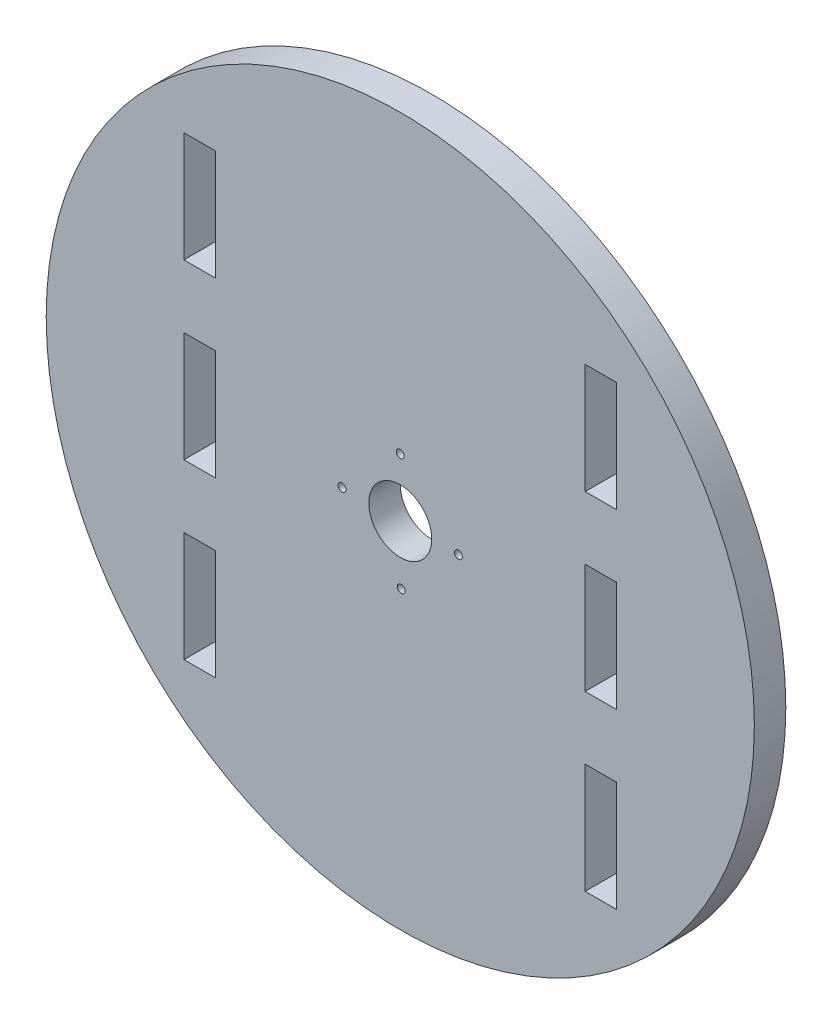
ISO-10303-21;
HEADER;
FILE_DESCRIPTION(('STEP AP214'),'2;1');
FILE_NAME('part.step','',(''),(''),'','','');
FILE_SCHEMA(('AUTOMOTIVE_DESIGN { 1 0 10303 214 1 1 1 1 }'));
ENDSEC;
DATA;
#1=APPLICATION_CONTEXT('core data for automotive mechanical design processes');
#2=APPLICATION_PROTOCOL_DEFINITION('international standard','automotive_design',2000,#1);
#3=PRODUCT_CONTEXT('',#1,'mechanical');
#4=PRODUCT('Part','Part','',(#3));
#5=PRODUCT_RELATED_PRODUCT_CATEGORY('part','',(#4));
#6=PRODUCT_DEFINITION_FORMATION('','',#4);
#7=PRODUCT_DEFINITION_CONTEXT('part definition',#1,'design');
#8=PRODUCT_DEFINITION('design','',#6,#7);
#9=PRODUCT_DEFINITION_SHAPE('','',#8);
#10=(LENGTH_UNIT() NAMED_UNIT(*) SI_UNIT(.MILLI.,.METRE.));
#11=(NAMED_UNIT(*) PLANE_ANGLE_UNIT() SI_UNIT($,.RADIAN.));
#12=(NAMED_UNIT(*) SI_UNIT($,.STERADIAN.) SOLID_ANGLE_UNIT());
#13=UNCERTAINTY_MEASURE_WITH_UNIT(LENGTH_MEASURE(1.E-05),#10,'distance_accuracy_value','');
#14=(GEOMETRIC_REPRESENTATION_CONTEXT(3) GLOBAL_UNCERTAINTY_ASSIGNED_CONTEXT((#13)) GLOBAL_UNIT_ASSIGNED_CONTEXT((#10,
#11,#12)) REPRESENTATION_CONTEXT('',''));
#15=CARTESIAN_POINT('',(0.,0.,0.));
#16=DIRECTION('',(0.,0.,1.));
#17=DIRECTION('',(1.,0.,0.));
#18=AXIS2_PLACEMENT_3D('',#15,#16,#17);
#19=CARTESIAN_POINT('',(68.5,-54.1414213562373,4.));
#20=DIRECTION('',(1.,0.,0.));
#21=DIRECTION('',(0.,0.,-1.));
#22=AXIS2_PLACEMENT_3D('',#19,#20,#21);
#23=PLANE('',#22);
#24=DIRECTION('',(0.,-1.,0.));
#25=VECTOR('',#24,1.);
#26=CARTESIAN_POINT('',(68.5,-54.1414213562373,0.));
#27=LINE('',#26,#25);
#28=CARTESIAN_POINT('',(68.5,74.,0.));
#29=VERTEX_POINT('',#28);
#30=CARTESIAN_POINT('',(68.5,60.,0.));
#31=VERTEX_POINT('',#30);
#32=EDGE_CURVE('E343',#29,#31,#27,.T.);
#33=ORIENTED_EDGE('',*,*,#32,.F.);
#34=DIRECTION('',(0.,0.,-1.));
#35=VECTOR('',#34,1.);
#36=CARTESIAN_POINT('',(68.5,74.,4.));
#37=LINE('',#36,#35);
#38=CARTESIAN_POINT('',(68.5,74.,4.));
#39=VERTEX_POINT('',#38);
#40=EDGE_CURVE('E11',#39,#29,#37,.T.);
#41=ORIENTED_EDGE('',*,*,#40,.F.);
#42=DIRECTION('',(0.,-1.,0.));
#43=VECTOR('',#42,1.);
#44=CARTESIAN_POINT('',(68.5,-54.1414213562373,4.));
#45=LINE('',#44,#43);
#46=CARTESIAN_POINT('',(68.5,60.,4.));
#47=VERTEX_POINT('',#46);
#48=EDGE_CURVE('E215',#39,#47,#45,.T.);
#49=ORIENTED_EDGE('',*,*,#48,.T.);
#50=DIRECTION('',(0.,0.,-1.));
#51=VECTOR('',#50,1.);
#52=CARTESIAN_POINT('',(68.5,60.,4.));
#53=LINE('',#52,#51);
#54=EDGE_CURVE('E51',#47,#31,#53,.T.);
#55=ORIENTED_EDGE('',*,*,#54,.T.);
#56=EDGE_LOOP('',(#33,#41,#49,#55));
#57=FACE_BOUND('',#56,.T.);
#58=ADVANCED_FACE('F32',(#57),#23,.T.);
#59=CARTESIAN_POINT('',(45.,74.,4.));
#60=DIRECTION('',(0.,1.,0.));
#61=DIRECTION('',(0.,0.,1.));
#62=AXIS2_PLACEMENT_3D('',#59,#60,#61);
#63=PLANE('',#62);
#64=DIRECTION('',(1.,0.,0.));
#65=VECTOR('',#64,1.);
#66=CARTESIAN_POINT('',(45.,74.,0.));
#67=LINE('',#66,#65);
#68=CARTESIAN_POINT('',(72.5,74.,0.));
#69=VERTEX_POINT('',#68);
#70=EDGE_CURVE('E220',#29,#69,#67,.T.);
#71=ORIENTED_EDGE('',*,*,#70,.T.);
#72=DIRECTION('',(0.,0.,-1.));
#73=VECTOR('',#72,1.);
#74=CARTESIAN_POINT('',(72.5,74.,4.));
#75=LINE('',#74,#73);
#76=CARTESIAN_POINT('',(72.5,74.,4.));
#77=VERTEX_POINT('',#76);
#78=EDGE_CURVE('E42',#77,#69,#75,.T.);
#79=ORIENTED_EDGE('',*,*,#78,.F.);
#80=DIRECTION('',(1.,0.,0.));
#81=VECTOR('',#80,1.);
#82=CARTESIAN_POINT('',(45.,74.,4.));
#83=LINE('',#82,#81);
#84=EDGE_CURVE('E209',#39,#77,#83,.T.);
#85=ORIENTED_EDGE('',*,*,#84,.F.);
#86=ORIENTED_EDGE('',*,*,#40,.T.);
#87=EDGE_LOOP('',(#71,#79,#85,#86));
#88=FACE_BOUND('',#87,.T.);
#89=ADVANCED_FACE('F218',(#88),#63,.F.);
#90=CARTESIAN_POINT('',(72.5,-54.1414213562373,4.));
#91=DIRECTION('',(1.,0.,0.));
#92=DIRECTION('',(0.,0.,-1.));
#93=AXIS2_PLACEMENT_3D('',#90,#91,#92);
#94=PLANE('',#93);
#95=DIRECTION('',(0.,-1.,0.));
#96=VECTOR('',#95,1.);
#97=CARTESIAN_POINT('',(72.5,-54.1414213562373,0.));
#98=LINE('',#97,#96);
#99=CARTESIAN_POINT('',(72.5,60.,0.));
#100=VERTEX_POINT('',#99);
#101=EDGE_CURVE('E346',#69,#100,#98,.T.);
#102=ORIENTED_EDGE('',*,*,#101,.T.);
#103=DIRECTION('',(0.,0.,-1.));
#104=VECTOR('',#103,1.);
#105=CARTESIAN_POINT('',(72.5,60.,4.));
#106=LINE('',#105,#104);
#107=CARTESIAN_POINT('',(72.5,60.,4.));
#108=VERTEX_POINT('',#107);
#109=EDGE_CURVE('E125',#108,#100,#106,.T.);
#110=ORIENTED_EDGE('',*,*,#109,.F.);
#111=DIRECTION('',(0.,-1.,0.));
#112=VECTOR('',#111,1.);
#113=CARTESIAN_POINT('',(72.5,-54.1414213562373,4.));
#114=LINE('',#113,#112);
#115=EDGE_CURVE('E201',#77,#108,#114,.T.);
#116=ORIENTED_EDGE('',*,*,#115,.F.);
#117=ORIENTED_EDGE('',*,*,#78,.T.);
#118=EDGE_LOOP('',(#102,#110,#116,#117));
#119=FACE_BOUND('',#118,.T.);
#120=ADVANCED_FACE('F203',(#119),#94,.F.);
#121=CARTESIAN_POINT('',(45.,16.,4.));
#122=DIRECTION('',(0.,1.,0.));
#123=DIRECTION('',(0.,0.,1.));
#124=AXIS2_PLACEMENT_3D('',#121,#122,#123);
#125=PLANE('',#124);
#126=DIRECTION('',(1.,0.,0.));
#127=VECTOR('',#126,1.);
#128=CARTESIAN_POINT('',(45.,16.,0.));
#129=LINE('',#128,#127);
#130=CARTESIAN_POINT('',(17.5,16.,0.));
#131=VERTEX_POINT('',#130);
#132=CARTESIAN_POINT('',(21.5,16.,0.));
#133=VERTEX_POINT('',#132);
#134=EDGE_CURVE('E331',#131,#133,#129,.T.);
#135=ORIENTED_EDGE('',*,*,#134,.F.);
#136=DIRECTION('',(0.,0.,-1.));
#137=VECTOR('',#136,1.);
#138=CARTESIAN_POINT('',(17.5,16.,4.));
#139=LINE('',#138,#137);
#140=CARTESIAN_POINT('',(17.5,16.,4.));
#141=VERTEX_POINT('',#140);
#142=EDGE_CURVE('E233',#141,#131,#139,.T.);
#143=ORIENTED_EDGE('',*,*,#142,.F.);
#144=DIRECTION('',(1.,0.,0.));
#145=VECTOR('',#144,1.);
#146=CARTESIAN_POINT('',(45.,16.,4.));
#147=LINE('',#146,#145);
#148=CARTESIAN_POINT('',(21.5,16.,4.));
#149=VERTEX_POINT('',#148);
#150=EDGE_CURVE('E409',#141,#149,#147,.T.);
#151=ORIENTED_EDGE('',*,*,#150,.T.);
#152=DIRECTION('',(0.,0.,-1.));
#153=VECTOR('',#152,1.);
#154=CARTESIAN_POINT('',(21.5,16.,4.));
#155=LINE('',#154,#153);
#156=EDGE_CURVE('E225',#149,#133,#155,.T.);
#157=ORIENTED_EDGE('',*,*,#156,.T.);
#158=EDGE_LOOP('',(#135,#143,#151,#157));
#159=FACE_BOUND('',#158,.T.);
#160=ADVANCED_FACE('F476',(#159),#125,.T.);
#161=CARTESIAN_POINT('',(17.5,-54.1414213562373,4.));
#162=DIRECTION('',(1.,0.,0.));
#163=DIRECTION('',(0.,0.,-1.));
#164=AXIS2_PLACEMENT_3D('',#161,#162,#163);
#165=PLANE('',#164);
#166=DIRECTION('',(0.,-1.,0.));
#167=VECTOR('',#166,1.);
#168=CARTESIAN_POINT('',(17.5,-54.1414213562373,0.));
#169=LINE('',#168,#167);
#170=CARTESIAN_POINT('',(17.5,30.,0.));
#171=VERTEX_POINT('',#170);
#172=EDGE_CURVE('E334',#171,#131,#169,.T.);
#173=ORIENTED_EDGE('',*,*,#172,.F.);
#174=DIRECTION('',(0.,0.,-1.));
#175=VECTOR('',#174,1.);
#176=CARTESIAN_POINT('',(17.5,30.,4.));
#177=LINE('',#176,#175);
#178=CARTESIAN_POINT('',(17.5,30.,4.));
#179=VERTEX_POINT('',#178);
#180=EDGE_CURVE('E231',#179,#171,#177,.T.);
#181=ORIENTED_EDGE('',*,*,#180,.F.);
#182=DIRECTION('',(0.,-1.,0.));
#183=VECTOR('',#182,1.);
#184=CARTESIAN_POINT('',(17.5,-54.1414213562373,4.));
#185=LINE('',#184,#183);
#186=EDGE_CURVE('E412',#179,#141,#185,.T.);
#187=ORIENTED_EDGE('',*,*,#186,.T.);
#188=ORIENTED_EDGE('',*,*,#142,.T.);
#189=EDGE_LOOP('',(#173,#181,#187,#188));
#190=FACE_BOUND('',#189,.T.);
#191=ADVANCED_FACE('F472',(#190),#165,.T.);
#192=CARTESIAN_POINT('',(45.,30.,4.));
#193=DIRECTION('',(0.,1.,0.));
#194=DIRECTION('',(0.,0.,1.));
#195=AXIS2_PLACEMENT_3D('',#192,#193,#194);
#196=PLANE('',#195);
#197=DIRECTION('',(1.,0.,0.));
#198=VECTOR('',#197,1.);
#199=CARTESIAN_POINT('',(45.,30.,0.));
#200=LINE('',#199,#198);
#201=CARTESIAN_POINT('',(21.5,30.,0.));
#202=VERTEX_POINT('',#201);
#203=EDGE_CURVE('E337',#171,#202,#200,.T.);
#204=ORIENTED_EDGE('',*,*,#203,.T.);
#205=DIRECTION('',(0.,0.,-1.));
#206=VECTOR('',#205,1.);
#207=CARTESIAN_POINT('',(21.5,30.,4.));
#208=LINE('',#207,#206);
#209=CARTESIAN_POINT('',(21.5,30.,4.));
#210=VERTEX_POINT('',#209);
#211=EDGE_CURVE('E227',#210,#202,#208,.T.);
#212=ORIENTED_EDGE('',*,*,#211,.F.);
#213=DIRECTION('',(1.,0.,0.));
#214=VECTOR('',#213,1.);
#215=CARTESIAN_POINT('',(45.,30.,4.));
#216=LINE('',#215,#214);
#217=EDGE_CURVE('E415',#179,#210,#216,.T.);
#218=ORIENTED_EDGE('',*,*,#217,.F.);
#219=ORIENTED_EDGE('',*,*,#180,.T.);
#220=EDGE_LOOP('',(#204,#212,#218,#219));
#221=FACE_BOUND('',#220,.T.);
#222=ADVANCED_FACE('F468',(#221),#196,.F.);
#223=CARTESIAN_POINT('',(45.,38.,4.));
#224=DIRECTION('',(0.,-1.,0.));
#225=DIRECTION('',(0.,0.,-1.));
#226=AXIS2_PLACEMENT_3D('',#223,#224,#225);
#227=PLANE('',#226);
#228=DIRECTION('',(-1.,0.,0.));
#229=VECTOR('',#228,1.);
#230=CARTESIAN_POINT('',(45.,38.,0.));
#231=LINE('',#230,#229);
#232=CARTESIAN_POINT('',(21.5,38.,0.));
#233=VERTEX_POINT('',#232);
#234=CARTESIAN_POINT('',(17.5,38.,0.));
#235=VERTEX_POINT('',#234);
#236=EDGE_CURVE('E322',#233,#235,#231,.T.);
#237=ORIENTED_EDGE('',*,*,#236,.T.);
#238=DIRECTION('',(0.,0.,-1.));
#239=VECTOR('',#238,1.);
#240=CARTESIAN_POINT('',(17.5,38.,4.));
#241=LINE('',#240,#239);
#242=CARTESIAN_POINT('',(17.5,38.,4.));
#243=VERTEX_POINT('',#242);
#244=EDGE_CURVE('E228',#243,#235,#241,.T.);
#245=ORIENTED_EDGE('',*,*,#244,.F.);
#246=DIRECTION('',(-1.,0.,0.));
#247=VECTOR('',#246,1.);
#248=CARTESIAN_POINT('',(45.,38.,4.));
#249=LINE('',#248,#247);
#250=CARTESIAN_POINT('',(21.5,38.,4.));
#251=VERTEX_POINT('',#250);
#252=EDGE_CURVE('E400',#251,#243,#249,.T.);
#253=ORIENTED_EDGE('',*,*,#252,.F.);
#254=DIRECTION('',(0.,0.,-1.));
#255=VECTOR('',#254,1.);
#256=CARTESIAN_POINT('',(21.5,38.,4.));
#257=LINE('',#256,#255);
#258=EDGE_CURVE('E235',#251,#233,#257,.T.);
#259=ORIENTED_EDGE('',*,*,#258,.T.);
#260=EDGE_LOOP('',(#237,#245,#253,#259));
#261=FACE_BOUND('',#260,.T.);
#262=ADVANCED_FACE('F471',(#261),#227,.F.);
#263=CARTESIAN_POINT('',(17.5,-54.1414213562373,4.));
#264=DIRECTION('',(-1.,0.,0.));
#265=DIRECTION('',(0.,0.,1.));
#266=AXIS2_PLACEMENT_3D('',#263,#264,#265);
#267=PLANE('',#266);
#268=DIRECTION('',(0.,1.,0.));
#269=VECTOR('',#268,1.);
#270=CARTESIAN_POINT('',(17.5,-54.1414213562373,0.));
#271=LINE('',#270,#269);
#272=CARTESIAN_POINT('',(17.5,52.,0.));
#273=VERTEX_POINT('',#272);
#274=EDGE_CURVE('E325',#235,#273,#271,.T.);
#275=ORIENTED_EDGE('',*,*,#274,.T.);
#276=DIRECTION('',(0.,0.,-1.));
#277=VECTOR('',#276,1.);
#278=CARTESIAN_POINT('',(17.5,52.,4.));
#279=LINE('',#278,#277);
#280=CARTESIAN_POINT('',(17.5,52.,4.));
#281=VERTEX_POINT('',#280);
#282=EDGE_CURVE('E242',#281,#273,#279,.T.);
#283=ORIENTED_EDGE('',*,*,#282,.F.);
#284=DIRECTION('',(0.,1.,0.));
#285=VECTOR('',#284,1.);
#286=CARTESIAN_POINT('',(17.5,-54.1414213562373,4.));
#287=LINE('',#286,#285);
#288=EDGE_CURVE('E403',#243,#281,#287,.T.);
#289=ORIENTED_EDGE('',*,*,#288,.F.);
#290=ORIENTED_EDGE('',*,*,#244,.T.);
#291=EDGE_LOOP('',(#275,#283,#289,#290));
#292=FACE_BOUND('',#291,.T.);
#293=ADVANCED_FACE('F489',(#292),#267,.F.);
#294=CARTESIAN_POINT('',(45.,52.,4.));
#295=DIRECTION('',(0.,1.,0.));
#296=DIRECTION('',(0.,0.,1.));
#297=AXIS2_PLACEMENT_3D('',#294,#295,#296);
#298=PLANE('',#297);
#299=DIRECTION('',(1.,0.,0.));
#300=VECTOR('',#299,1.);
#301=CARTESIAN_POINT('',(45.,52.,0.));
#302=LINE('',#301,#300);
#303=CARTESIAN_POINT('',(21.5,52.,0.));
#304=VERTEX_POINT('',#303);
#305=EDGE_CURVE('E327',#273,#304,#302,.T.);
#306=ORIENTED_EDGE('',*,*,#305,.T.);
#307=DIRECTION('',(0.,0.,-1.));
#308=VECTOR('',#307,1.);
#309=CARTESIAN_POINT('',(21.5,52.,4.));
#310=LINE('',#309,#308);
#311=CARTESIAN_POINT('',(21.5,52.,4.));
#312=VERTEX_POINT('',#311);
#313=EDGE_CURVE('E238',#312,#304,#310,.T.);
#314=ORIENTED_EDGE('',*,*,#313,.F.);
#315=DIRECTION('',(1.,0.,0.));
#316=VECTOR('',#315,1.);
#317=CARTESIAN_POINT('',(45.,52.,4.));
#318=LINE('',#317,#316);
#319=EDGE_CURVE('E405',#281,#312,#318,.T.);
#320=ORIENTED_EDGE('',*,*,#319,.F.);
#321=ORIENTED_EDGE('',*,*,#282,.T.);
#322=EDGE_LOOP('',(#306,#314,#320,#321));
#323=FACE_BOUND('',#322,.T.);
#324=ADVANCED_FACE('F485',(#323),#298,.F.);
#325=CARTESIAN_POINT('',(45.,30.,4.));
#326=DIRECTION('',(0.,1.,0.));
#327=DIRECTION('',(0.,0.,1.));
#328=AXIS2_PLACEMENT_3D('',#325,#326,#327);
#329=PLANE('',#328);
#330=DIRECTION('',(1.,0.,0.));
#331=VECTOR('',#330,1.);
#332=CARTESIAN_POINT('',(45.,30.,0.));
#333=LINE('',#332,#331);
#334=CARTESIAN_POINT('',(68.5,30.,0.));
#335=VERTEX_POINT('',#334);
#336=CARTESIAN_POINT('',(72.5,30.,0.));
#337=VERTEX_POINT('',#336);
#338=EDGE_CURVE('E311',#335,#337,#333,.T.);
#339=ORIENTED_EDGE('',*,*,#338,.T.);
#340=DIRECTION('',(0.,0.,-1.));
#341=VECTOR('',#340,1.);
#342=CARTESIAN_POINT('',(72.5,30.,4.));
#343=LINE('',#342,#341);
#344=CARTESIAN_POINT('',(72.5,30.,4.));
#345=VERTEX_POINT('',#344);
#346=EDGE_CURVE('E239',#345,#337,#343,.T.);
#347=ORIENTED_EDGE('',*,*,#346,.F.);
#348=DIRECTION('',(1.,0.,0.));
#349=VECTOR('',#348,1.);
#350=CARTESIAN_POINT('',(45.,30.,4.));
#351=LINE('',#350,#349);
#352=CARTESIAN_POINT('',(68.5,30.,4.));
#353=VERTEX_POINT('',#352);
#354=EDGE_CURVE('E390',#353,#345,#351,.T.);
#355=ORIENTED_EDGE('',*,*,#354,.F.);
#356=DIRECTION('',(0.,0.,-1.));
#357=VECTOR('',#356,1.);
#358=CARTESIAN_POINT('',(68.5,30.,4.));
#359=LINE('',#358,#357);
#360=EDGE_CURVE('E247',#353,#335,#359,.T.);
#361=ORIENTED_EDGE('',*,*,#360,.T.);
#362=EDGE_LOOP('',(#339,#347,#355,#361));
#363=FACE_BOUND('',#362,.T.);
#364=ADVANCED_FACE('F488',(#363),#329,.F.);
#365=CARTESIAN_POINT('',(72.5,-54.1414213562373,4.));
#366=DIRECTION('',(1.,0.,0.));
#367=DIRECTION('',(0.,0.,-1.));
#368=AXIS2_PLACEMENT_3D('',#365,#366,#367);
#369=PLANE('',#368);
#370=DIRECTION('',(0.,-1.,0.));
#371=VECTOR('',#370,1.);
#372=CARTESIAN_POINT('',(72.5,-54.1414213562373,0.));
#373=LINE('',#372,#371);
#374=CARTESIAN_POINT('',(72.5,16.,0.));
#375=VERTEX_POINT('',#374);
#376=EDGE_CURVE('E314',#337,#375,#373,.T.);
#377=ORIENTED_EDGE('',*,*,#376,.T.);
#378=DIRECTION('',(0.,0.,-1.));
#379=VECTOR('',#378,1.);
#380=CARTESIAN_POINT('',(72.5,16.,4.));
#381=LINE('',#380,#379);
#382=CARTESIAN_POINT('',(72.5,16.,4.));
#383=VERTEX_POINT('',#382);
#384=EDGE_CURVE('E252',#383,#375,#381,.T.);
#385=ORIENTED_EDGE('',*,*,#384,.F.);
#386=DIRECTION('',(0.,-1.,0.));
#387=VECTOR('',#386,1.);
#388=CARTESIAN_POINT('',(72.5,-54.1414213562373,4.));
#389=LINE('',#388,#387);
#390=EDGE_CURVE('E393',#345,#383,#389,.T.);
#391=ORIENTED_EDGE('',*,*,#390,.F.);
#392=ORIENTED_EDGE('',*,*,#346,.T.);
#393=EDGE_LOOP('',(#377,#385,#391,#392));
#394=FACE_BOUND('',#393,.T.);
#395=ADVANCED_FACE('F505',(#394),#369,.F.);
#396=CARTESIAN_POINT('',(45.,16.,4.));
#397=DIRECTION('',(0.,-1.,0.));
#398=DIRECTION('',(0.,0.,-1.));
#399=AXIS2_PLACEMENT_3D('',#396,#397,#398);
#400=PLANE('',#399);
#401=DIRECTION('',(-1.,0.,0.));
#402=VECTOR('',#401,1.);
#403=CARTESIAN_POINT('',(45.,16.,0.));
#404=LINE('',#403,#402);
#405=CARTESIAN_POINT('',(68.5,16.,0.));
#406=VERTEX_POINT('',#405);
#407=EDGE_CURVE('E316',#375,#406,#404,.T.);
#408=ORIENTED_EDGE('',*,*,#407,.T.);
#409=DIRECTION('',(0.,0.,-1.));
#410=VECTOR('',#409,1.);
#411=CARTESIAN_POINT('',(68.5,16.,4.));
#412=LINE('',#411,#410);
#413=CARTESIAN_POINT('',(68.5,16.,4.));
#414=VERTEX_POINT('',#413);
#415=EDGE_CURVE('E249',#414,#406,#412,.T.);
#416=ORIENTED_EDGE('',*,*,#415,.F.);
#417=DIRECTION('',(-1.,0.,0.));
#418=VECTOR('',#417,1.);
#419=CARTESIAN_POINT('',(45.,16.,4.));
#420=LINE('',#419,#418);
#421=EDGE_CURVE('E395',#383,#414,#420,.T.);
#422=ORIENTED_EDGE('',*,*,#421,.F.);
#423=ORIENTED_EDGE('',*,*,#384,.T.);
#424=EDGE_LOOP('',(#408,#416,#422,#423));
#425=FACE_BOUND('',#424,.T.);
#426=ADVANCED_FACE('F501',(#425),#400,.F.);
#427=CARTESIAN_POINT('',(45.,38.,4.));
#428=DIRECTION('',(0.,-1.,0.));
#429=DIRECTION('',(0.,0.,-1.));
#430=AXIS2_PLACEMENT_3D('',#427,#428,#429);
#431=PLANE('',#430);
#432=DIRECTION('',(-1.,0.,0.));
#433=VECTOR('',#432,1.);
#434=CARTESIAN_POINT('',(45.,38.,0.));
#435=LINE('',#434,#433);
#436=CARTESIAN_POINT('',(72.5,38.,0.));
#437=VERTEX_POINT('',#436);
#438=CARTESIAN_POINT('',(68.5,38.,0.));
#439=VERTEX_POINT('',#438);
#440=EDGE_CURVE('E302',#437,#439,#435,.T.);
#441=ORIENTED_EDGE('',*,*,#440,.T.);
#442=DIRECTION('',(0.,0.,-1.));
#443=VECTOR('',#442,1.);
#444=CARTESIAN_POINT('',(68.5,38.,4.));
#445=LINE('',#444,#443);
#446=CARTESIAN_POINT('',(68.5,38.,4.));
#447=VERTEX_POINT('',#446);
#448=EDGE_CURVE('E250',#447,#439,#445,.T.);
#449=ORIENTED_EDGE('',*,*,#448,.F.);
#450=DIRECTION('',(-1.,0.,0.));
#451=VECTOR('',#450,1.);
#452=CARTESIAN_POINT('',(45.,38.,4.));
#453=LINE('',#452,#451);
#454=CARTESIAN_POINT('',(72.5,38.,4.));
#455=VERTEX_POINT('',#454);
#456=EDGE_CURVE('E381',#455,#447,#453,.T.);
#457=ORIENTED_EDGE('',*,*,#456,.F.);
#458=DIRECTION('',(0.,0.,-1.));
#459=VECTOR('',#458,1.);
#460=CARTESIAN_POINT('',(72.5,38.,4.));
#461=LINE('',#460,#459);
#462=EDGE_CURVE('E257',#455,#437,#461,.T.);
#463=ORIENTED_EDGE('',*,*,#462,.T.);
#464=EDGE_LOOP('',(#441,#449,#457,#463));
#465=FACE_BOUND('',#464,.T.);
#466=ADVANCED_FACE('F504',(#465),#431,.F.);
#467=CARTESIAN_POINT('',(68.5,-54.1414213562373,4.));
#468=DIRECTION('',(-1.,0.,0.));
#469=DIRECTION('',(0.,0.,1.));
#470=AXIS2_PLACEMENT_3D('',#467,#468,#469);
#471=PLANE('',#470);
#472=DIRECTION('',(0.,1.,0.));
#473=VECTOR('',#472,1.);
#474=CARTESIAN_POINT('',(68.5,-54.1414213562373,0.));
#475=LINE('',#474,#473);
#476=CARTESIAN_POINT('',(68.5,52.,0.));
#477=VERTEX_POINT('',#476);
#478=EDGE_CURVE('E305',#439,#477,#475,.T.);
#479=ORIENTED_EDGE('',*,*,#478,.T.);
#480=DIRECTION('',(0.,0.,-1.));
#481=VECTOR('',#480,1.);
#482=CARTESIAN_POINT('',(68.5,52.,4.));
#483=LINE('',#482,#481);
#484=CARTESIAN_POINT('',(68.5,52.,4.));
#485=VERTEX_POINT('',#484);
#486=EDGE_CURVE('E263',#485,#477,#483,.T.);
#487=ORIENTED_EDGE('',*,*,#486,.F.);
#488=DIRECTION('',(0.,1.,0.));
#489=VECTOR('',#488,1.);
#490=CARTESIAN_POINT('',(68.5,-54.1414213562373,4.));
#491=LINE('',#490,#489);
#492=EDGE_CURVE('E384',#447,#485,#491,.T.);
#493=ORIENTED_EDGE('',*,*,#492,.F.);
#494=ORIENTED_EDGE('',*,*,#448,.T.);
#495=EDGE_LOOP('',(#479,#487,#493,#494));
#496=FACE_BOUND('',#495,.T.);
#497=ADVANCED_FACE('F519',(#496),#471,.F.);
#498=CARTESIAN_POINT('',(45.,52.,4.));
#499=DIRECTION('',(0.,1.,0.));
#500=DIRECTION('',(0.,0.,1.));
#501=AXIS2_PLACEMENT_3D('',#498,#499,#500);
#502=PLANE('',#501);
#503=DIRECTION('',(1.,0.,0.));
#504=VECTOR('',#503,1.);
#505=CARTESIAN_POINT('',(45.,52.,0.));
#506=LINE('',#505,#504);
#507=CARTESIAN_POINT('',(72.5,52.,0.));
#508=VERTEX_POINT('',#507);
#509=EDGE_CURVE('E307',#477,#508,#506,.T.);
#510=ORIENTED_EDGE('',*,*,#509,.T.);
#511=DIRECTION('',(0.,0.,-1.));
#512=VECTOR('',#511,1.);
#513=CARTESIAN_POINT('',(72.5,52.,4.));
#514=LINE('',#513,#512);
#515=CARTESIAN_POINT('',(72.5,52.,4.));
#516=VERTEX_POINT('',#515);
#517=EDGE_CURVE('E260',#516,#508,#514,.T.);
#518=ORIENTED_EDGE('',*,*,#517,.F.);
#519=DIRECTION('',(1.,0.,0.));
#520=VECTOR('',#519,1.);
#521=CARTESIAN_POINT('',(45.,52.,4.));
#522=LINE('',#521,#520);
#523=EDGE_CURVE('E386',#485,#516,#522,.T.);
#524=ORIENTED_EDGE('',*,*,#523,.F.);
#525=ORIENTED_EDGE('',*,*,#486,.T.);
#526=EDGE_LOOP('',(#510,#518,#524,#525));
#527=FACE_BOUND('',#526,.T.);
#528=ADVANCED_FACE('F516',(#527),#502,.F.);
#529=CARTESIAN_POINT('',(17.5,-54.1414213562373,4.));
#530=DIRECTION('',(-1.,0.,0.));
#531=DIRECTION('',(0.,0.,1.));
#532=AXIS2_PLACEMENT_3D('',#529,#530,#531);
#533=PLANE('',#532);
#534=DIRECTION('',(0.,1.,0.));
#535=VECTOR('',#534,1.);
#536=CARTESIAN_POINT('',(17.5,-54.1414213562373,0.));
#537=LINE('',#536,#535);
#538=CARTESIAN_POINT('',(17.5,60.,0.));
#539=VERTEX_POINT('',#538);
#540=CARTESIAN_POINT('',(17.5,74.,0.));
#541=VERTEX_POINT('',#540);
#542=EDGE_CURVE('E285',#539,#541,#537,.T.);
#543=ORIENTED_EDGE('',*,*,#542,.T.);
#544=DIRECTION('',(0.,0.,-1.));
#545=VECTOR('',#544,1.);
#546=CARTESIAN_POINT('',(17.5,74.,4.));
#547=LINE('',#546,#545);
#548=CARTESIAN_POINT('',(17.5,74.,4.));
#549=VERTEX_POINT('',#548);
#550=EDGE_CURVE('E36',#549,#541,#547,.T.);
#551=ORIENTED_EDGE('',*,*,#550,.F.);
#552=DIRECTION('',(0.,1.,0.));
#553=VECTOR('',#552,1.);
#554=CARTESIAN_POINT('',(17.5,-54.1414213562373,4.));
#555=LINE('',#554,#553);
#556=CARTESIAN_POINT('',(17.5,60.,4.));
#557=VERTEX_POINT('',#556);
#558=EDGE_CURVE('E373',#557,#549,#555,.T.);
#559=ORIENTED_EDGE('',*,*,#558,.F.);
#560=DIRECTION('',(0.,0.,-1.));
#561=VECTOR('',#560,1.);
#562=CARTESIAN_POINT('',(17.5,60.,4.));
#563=LINE('',#562,#561);
#564=EDGE_CURVE('E268',#557,#539,#563,.T.);
#565=ORIENTED_EDGE('',*,*,#564,.T.);
#566=EDGE_LOOP('',(#543,#551,#559,#565));
#567=FACE_BOUND('',#566,.T.);
#568=ADVANCED_FACE('F286',(#567),#533,.F.);
#569=CARTESIAN_POINT('',(45.,74.,4.));
#570=DIRECTION('',(0.,1.,0.));
#571=DIRECTION('',(0.,0.,1.));
#572=AXIS2_PLACEMENT_3D('',#569,#570,#571);
#573=PLANE('',#572);
#574=DIRECTION('',(1.,0.,0.));
#575=VECTOR('',#574,1.);
#576=CARTESIAN_POINT('',(45.,74.,0.));
#577=LINE('',#576,#575);
#578=CARTESIAN_POINT('',(21.5,74.,0.));
#579=VERTEX_POINT('',#578);
#580=EDGE_CURVE('E281',#541,#579,#577,.T.);
#581=ORIENTED_EDGE('',*,*,#580,.T.);
#582=DIRECTION('',(0.,0.,-1.));
#583=VECTOR('',#582,1.);
#584=CARTESIAN_POINT('',(21.5,74.,4.));
#585=LINE('',#584,#583);
#586=CARTESIAN_POINT('',(21.5,74.,4.));
#587=VERTEX_POINT('',#586);
#588=EDGE_CURVE('E272',#587,#579,#585,.T.);
#589=ORIENTED_EDGE('',*,*,#588,.F.);
#590=DIRECTION('',(1.,0.,0.));
#591=VECTOR('',#590,1.);
#592=CARTESIAN_POINT('',(45.,74.,4.));
#593=LINE('',#592,#591);
#594=EDGE_CURVE('E138',#549,#587,#593,.T.);
#595=ORIENTED_EDGE('',*,*,#594,.F.);
#596=ORIENTED_EDGE('',*,*,#550,.T.);
#597=EDGE_LOOP('',(#581,#589,#595,#596));
#598=FACE_BOUND('',#597,.T.);
#599=ADVANCED_FACE('F280',(#598),#573,.F.);
#600=CARTESIAN_POINT('',(21.5,-54.1414213562373,4.));
#601=DIRECTION('',(1.,0.,0.));
#602=DIRECTION('',(0.,0.,-1.));
#603=AXIS2_PLACEMENT_3D('',#600,#601,#602);
#604=PLANE('',#603);
#605=DIRECTION('',(0.,-1.,0.));
#606=VECTOR('',#605,1.);
#607=CARTESIAN_POINT('',(21.5,-54.1414213562373,0.));
#608=LINE('',#607,#606);
#609=CARTESIAN_POINT('',(21.5,60.,0.));
#610=VERTEX_POINT('',#609);
#611=EDGE_CURVE('E292',#579,#610,#608,.T.);
#612=ORIENTED_EDGE('',*,*,#611,.T.);
#613=DIRECTION('',(0.,0.,-1.));
#614=VECTOR('',#613,1.);
#615=CARTESIAN_POINT('',(21.5,60.,4.));
#616=LINE('',#615,#614);
#617=CARTESIAN_POINT('',(21.5,60.,4.));
#618=VERTEX_POINT('',#617);
#619=EDGE_CURVE('E270',#618,#610,#616,.T.);
#620=ORIENTED_EDGE('',*,*,#619,.F.);
#621=DIRECTION('',(0.,-1.,0.));
#622=VECTOR('',#621,1.);
#623=CARTESIAN_POINT('',(21.5,-54.1414213562373,4.));
#624=LINE('',#623,#622);
#625=EDGE_CURVE('E376',#587,#618,#624,.T.);
#626=ORIENTED_EDGE('',*,*,#625,.F.);
#627=ORIENTED_EDGE('',*,*,#588,.T.);
#628=EDGE_LOOP('',(#612,#620,#626,#627));
#629=FACE_BOUND('',#628,.T.);
#630=ADVANCED_FACE('F530',(#629),#604,.F.);
#631=CARTESIAN_POINT('',(45.,60.,4.));
#632=DIRECTION('',(0.,1.,0.));
#633=DIRECTION('',(0.,0.,1.));
#634=AXIS2_PLACEMENT_3D('',#631,#632,#633);
#635=PLANE('',#634);
#636=DIRECTION('',(1.,0.,0.));
#637=VECTOR('',#636,1.);
#638=CARTESIAN_POINT('',(45.,60.,0.));
#639=LINE('',#638,#637);
#640=EDGE_CURVE('E348',#31,#100,#639,.T.);
#641=ORIENTED_EDGE('',*,*,#640,.F.);
#642=ORIENTED_EDGE('',*,*,#54,.F.);
#643=DIRECTION('',(1.,0.,0.));
#644=VECTOR('',#643,1.);
#645=CARTESIAN_POINT('',(45.,60.,4.));
#646=LINE('',#645,#644);
#647=EDGE_CURVE('E208',#47,#108,#646,.T.);
#648=ORIENTED_EDGE('',*,*,#647,.T.);
#649=ORIENTED_EDGE('',*,*,#109,.T.);
#650=EDGE_LOOP('',(#641,#642,#648,#649));
#651=FACE_BOUND('',#650,.T.);
#652=ADVANCED_FACE('F466',(#651),#635,.T.);
#653=CARTESIAN_POINT('',(21.5,-54.1414213562373,4.));
#654=DIRECTION('',(1.,0.,0.));
#655=DIRECTION('',(0.,0.,-1.));
#656=AXIS2_PLACEMENT_3D('',#653,#654,#655);
#657=PLANE('',#656);
#658=DIRECTION('',(0.,-1.,0.));
#659=VECTOR('',#658,1.);
#660=CARTESIAN_POINT('',(21.5,-54.1414213562373,0.));
#661=LINE('',#660,#659);
#662=EDGE_CURVE('E340',#202,#133,#661,.T.);
#663=ORIENTED_EDGE('',*,*,#662,.T.);
#664=ORIENTED_EDGE('',*,*,#156,.F.);
#665=DIRECTION('',(0.,-1.,0.));
#666=VECTOR('',#665,1.);
#667=CARTESIAN_POINT('',(21.5,-54.1414213562373,4.));
#668=LINE('',#667,#666);
#669=EDGE_CURVE('E418',#210,#149,#668,.T.);
#670=ORIENTED_EDGE('',*,*,#669,.F.);
#671=ORIENTED_EDGE('',*,*,#211,.T.);
#672=EDGE_LOOP('',(#663,#664,#670,#671));
#673=FACE_BOUND('',#672,.T.);
#674=ADVANCED_FACE('F462',(#673),#657,.F.);
#675=CARTESIAN_POINT('',(21.5,-54.1414213562373,4.));
#676=DIRECTION('',(1.,0.,0.));
#677=DIRECTION('',(0.,0.,-1.));
#678=AXIS2_PLACEMENT_3D('',#675,#676,#677);
#679=PLANE('',#678);
#680=DIRECTION('',(0.,-1.,0.));
#681=VECTOR('',#680,1.);
#682=CARTESIAN_POINT('',(21.5,-54.1414213562373,0.));
#683=LINE('',#682,#681);
#684=EDGE_CURVE('E329',#304,#233,#683,.T.);
#685=ORIENTED_EDGE('',*,*,#684,.T.);
#686=ORIENTED_EDGE('',*,*,#258,.F.);
#687=DIRECTION('',(0.,-1.,0.));
#688=VECTOR('',#687,1.);
#689=CARTESIAN_POINT('',(21.5,-54.1414213562373,4.));
#690=LINE('',#689,#688);
#691=EDGE_CURVE('E407',#312,#251,#690,.T.);
#692=ORIENTED_EDGE('',*,*,#691,.F.);
#693=ORIENTED_EDGE('',*,*,#313,.T.);
#694=EDGE_LOOP('',(#685,#686,#692,#693));
#695=FACE_BOUND('',#694,.T.);
#696=ADVANCED_FACE('F465',(#695),#679,.F.);
#697=CARTESIAN_POINT('',(68.5,-54.1414213562373,4.));
#698=DIRECTION('',(1.,0.,0.));
#699=DIRECTION('',(0.,0.,-1.));
#700=AXIS2_PLACEMENT_3D('',#697,#698,#699);
#701=PLANE('',#700);
#702=DIRECTION('',(0.,-1.,0.));
#703=VECTOR('',#702,1.);
#704=CARTESIAN_POINT('',(68.5,-54.1414213562373,0.));
#705=LINE('',#704,#703);
#706=EDGE_CURVE('E319',#335,#406,#705,.T.);
#707=ORIENTED_EDGE('',*,*,#706,.F.);
#708=ORIENTED_EDGE('',*,*,#360,.F.);
#709=DIRECTION('',(0.,-1.,0.));
#710=VECTOR('',#709,1.);
#711=CARTESIAN_POINT('',(68.5,-54.1414213562373,4.));
#712=LINE('',#711,#710);
#713=EDGE_CURVE('E397',#353,#414,#712,.T.);
#714=ORIENTED_EDGE('',*,*,#713,.T.);
#715=ORIENTED_EDGE('',*,*,#415,.T.);
#716=EDGE_LOOP('',(#707,#708,#714,#715));
#717=FACE_BOUND('',#716,.T.);
#718=ADVANCED_FACE('F483',(#717),#701,.T.);
#719=CARTESIAN_POINT('',(72.5,-54.1414213562373,4.));
#720=DIRECTION('',(1.,0.,0.));
#721=DIRECTION('',(0.,0.,-1.));
#722=AXIS2_PLACEMENT_3D('',#719,#720,#721);
#723=PLANE('',#722);
#724=DIRECTION('',(0.,-1.,0.));
#725=VECTOR('',#724,1.);
#726=CARTESIAN_POINT('',(72.5,-54.1414213562373,0.));
#727=LINE('',#726,#725);
#728=EDGE_CURVE('E309',#508,#437,#727,.T.);
#729=ORIENTED_EDGE('',*,*,#728,.T.);
#730=ORIENTED_EDGE('',*,*,#462,.F.);
#731=DIRECTION('',(0.,-1.,0.));
#732=VECTOR('',#731,1.);
#733=CARTESIAN_POINT('',(72.5,-54.1414213562373,4.));
#734=LINE('',#733,#732);
#735=EDGE_CURVE('E388',#516,#455,#734,.T.);
#736=ORIENTED_EDGE('',*,*,#735,.F.);
#737=ORIENTED_EDGE('',*,*,#517,.T.);
#738=EDGE_LOOP('',(#729,#730,#736,#737));
#739=FACE_BOUND('',#738,.T.);
#740=ADVANCED_FACE('F499',(#739),#723,.F.);
#741=CARTESIAN_POINT('',(45.,60.,4.));
#742=DIRECTION('',(0.,1.,0.));
#743=DIRECTION('',(0.,0.,1.));
#744=AXIS2_PLACEMENT_3D('',#741,#742,#743);
#745=PLANE('',#744);
#746=DIRECTION('',(1.,0.,0.));
#747=VECTOR('',#746,1.);
#748=CARTESIAN_POINT('',(45.,60.,0.));
#749=LINE('',#748,#747);
#750=EDGE_CURVE('E300',#539,#610,#749,.T.);
#751=ORIENTED_EDGE('',*,*,#750,.F.);
#752=ORIENTED_EDGE('',*,*,#564,.F.);
#753=DIRECTION('',(1.,0.,0.));
#754=VECTOR('',#753,1.);
#755=CARTESIAN_POINT('',(45.,60.,4.));
#756=LINE('',#755,#754);
#757=EDGE_CURVE('E378',#557,#618,#756,.T.);
#758=ORIENTED_EDGE('',*,*,#757,.T.);
#759=ORIENTED_EDGE('',*,*,#619,.T.);
#760=EDGE_LOOP('',(#751,#752,#758,#759));
#761=FACE_BOUND('',#760,.T.);
#762=ADVANCED_FACE('F451',(#761),#745,.T.);
#763=CARTESIAN_POINT('',(45.,45.,4.));
#764=DIRECTION('',(0.,0.,-1.));
#765=DIRECTION('',(-1.,0.,0.));
#766=AXIS2_PLACEMENT_3D('',#763,#764,#765);
#767=CYLINDRICAL_SURFACE('',#766,4.);
#768=CARTESIAN_POINT('',(45.,45.,4.));
#769=DIRECTION('',(0.,0.,1.));
#770=DIRECTION('',(1.,0.,0.));
#771=AXIS2_PLACEMENT_3D('',#768,#769,#770);
#772=CIRCLE('',#771,4.);
#773=CARTESIAN_POINT('',(49.,45.,4.));
#774=VERTEX_POINT('',#773);
#775=EDGE_CURVE('E370',#774,#774,#772,.T.);
#776=ORIENTED_EDGE('',*,*,#775,.T.);
#777=EDGE_LOOP('',(#776));
#778=FACE_BOUND('',#777,.T.);
#779=CARTESIAN_POINT('',(45.,45.,0.));
#780=DIRECTION('',(0.,0.,1.));
#781=DIRECTION('',(1.,0.,0.));
#782=AXIS2_PLACEMENT_3D('',#779,#780,#781);
#783=CIRCLE('',#782,4.);
#784=CARTESIAN_POINT('',(49.,45.,0.));
#785=VERTEX_POINT('',#784);
#786=EDGE_CURVE('E290',#785,#785,#783,.T.);
#787=ORIENTED_EDGE('',*,*,#786,.F.);
#788=EDGE_LOOP('',(#787));
#789=FACE_BOUND('',#788,.T.);
#790=ADVANCED_FACE('F441',(#778,#789),#767,.F.);
#791=CARTESIAN_POINT('',(45.,52.4,4.));
#792=DIRECTION('',(0.,0.,-1.));
#793=DIRECTION('',(-1.,0.,0.));
#794=AXIS2_PLACEMENT_3D('',#791,#792,#793);
#795=CYLINDRICAL_SURFACE('',#794,0.5);
#796=CARTESIAN_POINT('',(45.,52.4,4.));
#797=DIRECTION('',(0.,0.,1.));
#798=DIRECTION('',(1.,0.,0.));
#799=AXIS2_PLACEMENT_3D('',#796,#797,#798);
#800=CIRCLE('',#799,0.5);
#801=CARTESIAN_POINT('',(45.5,52.4,4.));
#802=VERTEX_POINT('',#801);
#803=EDGE_CURVE('E367',#802,#802,#800,.T.);
#804=ORIENTED_EDGE('',*,*,#803,.T.);
#805=EDGE_LOOP('',(#804));
#806=FACE_BOUND('',#805,.T.);
#807=CARTESIAN_POINT('',(45.,52.4,0.));
#808=DIRECTION('',(0.,0.,1.));
#809=DIRECTION('',(1.,0.,0.));
#810=AXIS2_PLACEMENT_3D('',#807,#808,#809);
#811=CIRCLE('',#810,0.5);
#812=CARTESIAN_POINT('',(45.5,52.4,0.));
#813=VERTEX_POINT('',#812);
#814=EDGE_CURVE('E295',#813,#813,#811,.T.);
#815=ORIENTED_EDGE('',*,*,#814,.F.);
#816=EDGE_LOOP('',(#815));
#817=FACE_BOUND('',#816,.T.);
#818=ADVANCED_FACE('F438',(#806,#817),#795,.F.);
#819=CARTESIAN_POINT('',(45.1210251621469,37.6009897344221,4.));
#820=DIRECTION('',(0.,0.,-1.));
#821=DIRECTION('',(-1.,0.,0.));
#822=AXIS2_PLACEMENT_3D('',#819,#820,#821);
#823=CYLINDRICAL_SURFACE('',#822,0.5);
#824=CARTESIAN_POINT('',(45.1210251621469,37.6009897344221,4.));
#825=DIRECTION('',(0.,0.,1.));
#826=DIRECTION('',(1.,0.,0.));
#827=AXIS2_PLACEMENT_3D('',#824,#825,#826);
#828=CIRCLE('',#827,0.5);
#829=CARTESIAN_POINT('',(45.6210251621469,37.6009897344221,4.));
#830=VERTEX_POINT('',#829);
#831=EDGE_CURVE('E362',#830,#830,#828,.T.);
#832=ORIENTED_EDGE('',*,*,#831,.T.);
#833=EDGE_LOOP('',(#832));
#834=FACE_BOUND('',#833,.T.);
#835=CARTESIAN_POINT('',(45.1210251621469,37.6009897344221,0.));
#836=DIRECTION('',(0.,0.,1.));
#837=DIRECTION('',(1.,0.,0.));
#838=AXIS2_PLACEMENT_3D('',#835,#836,#837);
#839=CIRCLE('',#838,0.5);
#840=CARTESIAN_POINT('',(45.6210251621469,37.6009897344221,0.));
#841=VERTEX_POINT('',#840);
#842=EDGE_CURVE('E430',#841,#841,#839,.T.);
#843=ORIENTED_EDGE('',*,*,#842,.F.);
#844=EDGE_LOOP('',(#843));
#845=FACE_BOUND('',#844,.T.);
#846=ADVANCED_FACE('F440',(#834,#845),#823,.F.);
#847=CARTESIAN_POINT('',(52.4,45.,4.));
#848=DIRECTION('',(0.,0.,-1.));
#849=DIRECTION('',(-1.,0.,0.));
#850=AXIS2_PLACEMENT_3D('',#847,#848,#849);
#851=CYLINDRICAL_SURFACE('',#850,0.5);
#852=CARTESIAN_POINT('',(52.4,45.,4.));
#853=DIRECTION('',(0.,0.,1.));
#854=DIRECTION('',(1.,0.,0.));
#855=AXIS2_PLACEMENT_3D('',#852,#853,#854);
#856=CIRCLE('',#855,0.5);
#857=CARTESIAN_POINT('',(52.9,45.,4.));
#858=VERTEX_POINT('',#857);
#859=EDGE_CURVE('E357',#858,#858,#856,.T.);
#860=ORIENTED_EDGE('',*,*,#859,.T.);
#861=EDGE_LOOP('',(#860));
#862=FACE_BOUND('',#861,.T.);
#863=CARTESIAN_POINT('',(52.4,45.,0.));
#864=DIRECTION('',(0.,0.,1.));
#865=DIRECTION('',(1.,0.,0.));
#866=AXIS2_PLACEMENT_3D('',#863,#864,#865);
#867=CIRCLE('',#866,0.5);
#868=CARTESIAN_POINT('',(52.9,45.,0.));
#869=VERTEX_POINT('',#868);
#870=EDGE_CURVE('E427',#869,#869,#867,.T.);
#871=ORIENTED_EDGE('',*,*,#870,.F.);
#872=EDGE_LOOP('',(#871));
#873=FACE_BOUND('',#872,.T.);
#874=ADVANCED_FACE('F448',(#862,#873),#851,.F.);
#875=CARTESIAN_POINT('',(37.6,45.,4.));
#876=DIRECTION('',(0.,0.,-1.));
#877=DIRECTION('',(-1.,0.,0.));
#878=AXIS2_PLACEMENT_3D('',#875,#876,#877);
#879=CYLINDRICAL_SURFACE('',#878,0.5);
#880=CARTESIAN_POINT('',(37.6,45.,4.));
#881=DIRECTION('',(0.,0.,1.));
#882=DIRECTION('',(1.,0.,0.));
#883=AXIS2_PLACEMENT_3D('',#880,#881,#882);
#884=CIRCLE('',#883,0.5);
#885=CARTESIAN_POINT('',(38.1,45.,4.));
#886=VERTEX_POINT('',#885);
#887=EDGE_CURVE('E353',#886,#886,#884,.T.);
#888=ORIENTED_EDGE('',*,*,#887,.T.);
#889=EDGE_LOOP('',(#888));
#890=FACE_BOUND('',#889,.T.);
#891=CARTESIAN_POINT('',(37.6,45.,0.));
#892=DIRECTION('',(0.,0.,1.));
#893=DIRECTION('',(1.,0.,0.));
#894=AXIS2_PLACEMENT_3D('',#891,#892,#893);
#895=CIRCLE('',#894,0.5);
#896=CARTESIAN_POINT('',(38.1,45.,0.));
#897=VERTEX_POINT('',#896);
#898=EDGE_CURVE('E424',#897,#897,#895,.T.);
#899=ORIENTED_EDGE('',*,*,#898,.F.);
#900=EDGE_LOOP('',(#899));
#901=FACE_BOUND('',#900,.T.);
#902=ADVANCED_FACE('F34',(#890,#901),#879,.F.);
#903=CARTESIAN_POINT('',(45.,45.,4.));
#904=DIRECTION('',(0.,0.,-1.));
#905=DIRECTION('',(-1.,0.,0.));
#906=AXIS2_PLACEMENT_3D('',#903,#904,#905);
#907=CYLINDRICAL_SURFACE('',#906,45.);
#908=CARTESIAN_POINT('',(45.,45.,4.));
#909=DIRECTION('',(0.,0.,1.));
#910=DIRECTION('',(1.,0.,0.));
#911=AXIS2_PLACEMENT_3D('',#908,#909,#910);
#912=CIRCLE('',#911,45.);
#913=CARTESIAN_POINT('',(90.,45.,4.));
#914=VERTEX_POINT('',#913);
#915=EDGE_CURVE('E271',#914,#914,#912,.T.);
#916=ORIENTED_EDGE('',*,*,#915,.F.);
#917=EDGE_LOOP('',(#916));
#918=FACE_BOUND('',#917,.T.);
#919=CARTESIAN_POINT('',(45.,45.,0.));
#920=DIRECTION('',(0.,0.,1.));
#921=DIRECTION('',(1.,0.,0.));
#922=AXIS2_PLACEMENT_3D('',#919,#920,#921);
#923=CIRCLE('',#922,45.);
#924=CARTESIAN_POINT('',(90.,45.,0.));
#925=VERTEX_POINT('',#924);
#926=EDGE_CURVE('E351',#925,#925,#923,.T.);
#927=ORIENTED_EDGE('',*,*,#926,.T.);
#928=EDGE_LOOP('',(#927));
#929=FACE_BOUND('',#928,.T.);
#930=ADVANCED_FACE('F605',(#918,#929),#907,.T.);
#931=CARTESIAN_POINT('',(45.,-54.1414213562373,4.));
#932=DIRECTION('',(0.,0.,1.));
#933=DIRECTION('',(1.,0.,0.));
#934=AXIS2_PLACEMENT_3D('',#931,#932,#933);
#935=PLANE('',#934);
#936=ORIENTED_EDGE('',*,*,#887,.F.);
#937=EDGE_LOOP('',(#936));
#938=FACE_BOUND('',#937,.T.);
#939=ORIENTED_EDGE('',*,*,#859,.F.);
#940=EDGE_LOOP('',(#939));
#941=FACE_BOUND('',#940,.T.);
#942=ORIENTED_EDGE('',*,*,#831,.F.);
#943=EDGE_LOOP('',(#942));
#944=FACE_BOUND('',#943,.T.);
#945=ORIENTED_EDGE('',*,*,#803,.F.);
#946=EDGE_LOOP('',(#945));
#947=FACE_BOUND('',#946,.T.);
#948=ORIENTED_EDGE('',*,*,#775,.F.);
#949=EDGE_LOOP('',(#948));
#950=FACE_BOUND('',#949,.T.);
#951=ORIENTED_EDGE('',*,*,#558,.T.);
#952=ORIENTED_EDGE('',*,*,#594,.T.);
#953=ORIENTED_EDGE('',*,*,#625,.T.);
#954=ORIENTED_EDGE('',*,*,#757,.F.);
#955=EDGE_LOOP('',(#951,#952,#953,#954));
#956=FACE_BOUND('',#955,.T.);
#957=ORIENTED_EDGE('',*,*,#456,.T.);
#958=ORIENTED_EDGE('',*,*,#492,.T.);
#959=ORIENTED_EDGE('',*,*,#523,.T.);
#960=ORIENTED_EDGE('',*,*,#735,.T.);
#961=EDGE_LOOP('',(#957,#958,#959,#960));
#962=FACE_BOUND('',#961,.T.);
#963=ORIENTED_EDGE('',*,*,#354,.T.);
#964=ORIENTED_EDGE('',*,*,#390,.T.);
#965=ORIENTED_EDGE('',*,*,#421,.T.);
#966=ORIENTED_EDGE('',*,*,#713,.F.);
#967=EDGE_LOOP('',(#963,#964,#965,#966));
#968=FACE_BOUND('',#967,.T.);
#969=ORIENTED_EDGE('',*,*,#252,.T.);
#970=ORIENTED_EDGE('',*,*,#288,.T.);
#971=ORIENTED_EDGE('',*,*,#319,.T.);
#972=ORIENTED_EDGE('',*,*,#691,.T.);
#973=EDGE_LOOP('',(#969,#970,#971,#972));
#974=FACE_BOUND('',#973,.T.);
#975=ORIENTED_EDGE('',*,*,#150,.F.);
#976=ORIENTED_EDGE('',*,*,#186,.F.);
#977=ORIENTED_EDGE('',*,*,#217,.T.);
#978=ORIENTED_EDGE('',*,*,#669,.T.);
#979=EDGE_LOOP('',(#975,#976,#977,#978));
#980=FACE_BOUND('',#979,.T.);
#981=ORIENTED_EDGE('',*,*,#48,.F.);
#982=ORIENTED_EDGE('',*,*,#84,.T.);
#983=ORIENTED_EDGE('',*,*,#115,.T.);
#984=ORIENTED_EDGE('',*,*,#647,.F.);
#985=EDGE_LOOP('',(#981,#982,#983,#984));
#986=FACE_BOUND('',#985,.T.);
#987=ORIENTED_EDGE('',*,*,#915,.T.);
#988=EDGE_LOOP('',(#987));
#989=FACE_BOUND('',#988,.T.);
#990=ADVANCED_FACE('F213',(#938,#941,#944,#947,#950,#956,#962,#968,#974,#980,#986,#989),#935,.T.);
#991=CARTESIAN_POINT('',(45.,-54.1414213562373,0.));
#992=DIRECTION('',(0.,0.,1.));
#993=DIRECTION('',(1.,0.,0.));
#994=AXIS2_PLACEMENT_3D('',#991,#992,#993);
#995=PLANE('',#994);
#996=ORIENTED_EDGE('',*,*,#898,.T.);
#997=EDGE_LOOP('',(#996));
#998=FACE_BOUND('',#997,.T.);
#999=ORIENTED_EDGE('',*,*,#870,.T.);
#1000=EDGE_LOOP('',(#999));
#1001=FACE_BOUND('',#1000,.T.);
#1002=ORIENTED_EDGE('',*,*,#842,.T.);
#1003=EDGE_LOOP('',(#1002));
#1004=FACE_BOUND('',#1003,.T.);
#1005=ORIENTED_EDGE('',*,*,#814,.T.);
#1006=EDGE_LOOP('',(#1005));
#1007=FACE_BOUND('',#1006,.T.);
#1008=ORIENTED_EDGE('',*,*,#786,.T.);
#1009=EDGE_LOOP('',(#1008));
#1010=FACE_BOUND('',#1009,.T.);
#1011=ORIENTED_EDGE('',*,*,#542,.F.);
#1012=ORIENTED_EDGE('',*,*,#750,.T.);
#1013=ORIENTED_EDGE('',*,*,#611,.F.);
#1014=ORIENTED_EDGE('',*,*,#580,.F.);
#1015=EDGE_LOOP('',(#1011,#1012,#1013,#1014));
#1016=FACE_BOUND('',#1015,.T.);
#1017=ORIENTED_EDGE('',*,*,#440,.F.);
#1018=ORIENTED_EDGE('',*,*,#728,.F.);
#1019=ORIENTED_EDGE('',*,*,#509,.F.);
#1020=ORIENTED_EDGE('',*,*,#478,.F.);
#1021=EDGE_LOOP('',(#1017,#1018,#1019,#1020));
#1022=FACE_BOUND('',#1021,.T.);
#1023=ORIENTED_EDGE('',*,*,#338,.F.);
#1024=ORIENTED_EDGE('',*,*,#706,.T.);
#1025=ORIENTED_EDGE('',*,*,#407,.F.);
#1026=ORIENTED_EDGE('',*,*,#376,.F.);
#1027=EDGE_LOOP('',(#1023,#1024,#1025,#1026));
#1028=FACE_BOUND('',#1027,.T.);
#1029=ORIENTED_EDGE('',*,*,#236,.F.);
#1030=ORIENTED_EDGE('',*,*,#684,.F.);
#1031=ORIENTED_EDGE('',*,*,#305,.F.);
#1032=ORIENTED_EDGE('',*,*,#274,.F.);
#1033=EDGE_LOOP('',(#1029,#1030,#1031,#1032));
#1034=FACE_BOUND('',#1033,.T.);
#1035=ORIENTED_EDGE('',*,*,#134,.T.);
#1036=ORIENTED_EDGE('',*,*,#662,.F.);
#1037=ORIENTED_EDGE('',*,*,#203,.F.);
#1038=ORIENTED_EDGE('',*,*,#172,.T.);
#1039=EDGE_LOOP('',(#1035,#1036,#1037,#1038));
#1040=FACE_BOUND('',#1039,.T.);
#1041=ORIENTED_EDGE('',*,*,#32,.T.);
#1042=ORIENTED_EDGE('',*,*,#640,.T.);
#1043=ORIENTED_EDGE('',*,*,#101,.F.);
#1044=ORIENTED_EDGE('',*,*,#70,.F.);
#1045=EDGE_LOOP('',(#1041,#1042,#1043,#1044));
#1046=FACE_BOUND('',#1045,.T.);
#1047=ORIENTED_EDGE('',*,*,#926,.F.);
#1048=EDGE_LOOP('',(#1047));
#1049=FACE_BOUND('',#1048,.T.);
#1050=ADVANCED_FACE('F435',(#998,#1001,#1004,#1007,#1010,#1016,#1022,#1028,#1034,#1040,#1046,
#1049),#995,.F.);
#1051=CLOSED_SHELL('',(#58,#89,#120,#160,#191,#222,#262,#293,#324,#364,#395,#426,#466,#497,#528,
#568,#599,#630,#652,#674,#696,#718,#740,#762,#790,#818,#846,#874,#902,#930,#990,#1050));
#1052=MANIFOLD_SOLID_BREP('B2',#1051);
#1053=ADVANCED_BREP_SHAPE_REPRESENTATION('',(#18,#1052),#14);
#1054=SHAPE_DEFINITION_REPRESENTATION(#9,#1053);
ENDSEC;
END-ISO-10303-21;
